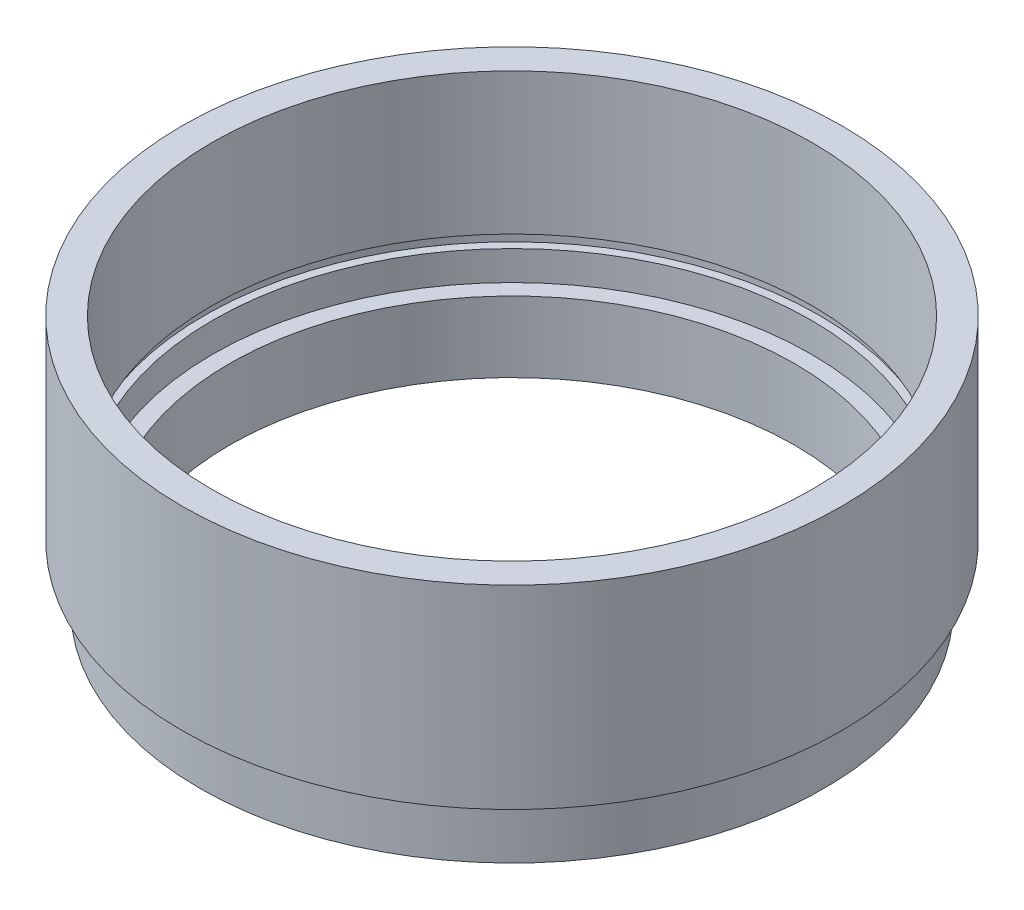
ISO-10303-21;
HEADER;
FILE_DESCRIPTION(('STEP AP214'),'2;1');
FILE_NAME('part.step','',(''),(''),'','','');
FILE_SCHEMA(('AUTOMOTIVE_DESIGN { 1 0 10303 214 1 1 1 1 }'));
ENDSEC;
DATA;
#1=APPLICATION_CONTEXT('core data for automotive mechanical design processes');
#2=APPLICATION_PROTOCOL_DEFINITION('international standard','automotive_design',2000,#1);
#3=PRODUCT_CONTEXT('',#1,'mechanical');
#4=PRODUCT('Part','Part','',(#3));
#5=PRODUCT_RELATED_PRODUCT_CATEGORY('part','',(#4));
#6=PRODUCT_DEFINITION_FORMATION('','',#4);
#7=PRODUCT_DEFINITION_CONTEXT('part definition',#1,'design');
#8=PRODUCT_DEFINITION('design','',#6,#7);
#9=PRODUCT_DEFINITION_SHAPE('','',#8);
#10=(LENGTH_UNIT() NAMED_UNIT(*) SI_UNIT(.MILLI.,.METRE.));
#11=(NAMED_UNIT(*) PLANE_ANGLE_UNIT() SI_UNIT($,.RADIAN.));
#12=(NAMED_UNIT(*) SI_UNIT($,.STERADIAN.) SOLID_ANGLE_UNIT());
#13=UNCERTAINTY_MEASURE_WITH_UNIT(LENGTH_MEASURE(1.E-05),#10,'distance_accuracy_value','');
#14=(GEOMETRIC_REPRESENTATION_CONTEXT(3) GLOBAL_UNCERTAINTY_ASSIGNED_CONTEXT((#13)) GLOBAL_UNIT_ASSIGNED_CONTEXT((#10,
#11,#12)) REPRESENTATION_CONTEXT('',''));
#15=CARTESIAN_POINT('',(0.,0.,0.));
#16=DIRECTION('',(0.,0.,1.));
#17=DIRECTION('',(1.,0.,0.));
#18=AXIS2_PLACEMENT_3D('',#15,#16,#17);
#19=CARTESIAN_POINT('',(0.,0.,0.));
#20=DIRECTION('',(0.,-1.,0.));
#21=DIRECTION('',(0.,0.,-1.));
#22=AXIS2_PLACEMENT_3D('',#19,#20,#21);
#23=CYLINDRICAL_SURFACE('',#22,24.);
#24=CARTESIAN_POINT('',(0.,0.,0.));
#25=DIRECTION('',(0.,-1.,0.));
#26=DIRECTION('',(0.,0.,-1.));
#27=AXIS2_PLACEMENT_3D('',#24,#25,#26);
#28=CIRCLE('',#27,24.);
#29=CARTESIAN_POINT('',(0.,0.,-24.));
#30=VERTEX_POINT('',#29);
#31=EDGE_CURVE('E10',#30,#30,#28,.T.);
#32=ORIENTED_EDGE('',*,*,#31,.T.);
#33=EDGE_LOOP('',(#32));
#34=FACE_BOUND('',#33,.T.);
#35=CARTESIAN_POINT('',(0.,6.,0.));
#36=DIRECTION('',(0.,-1.,0.));
#37=DIRECTION('',(0.,0.,-1.));
#38=AXIS2_PLACEMENT_3D('',#35,#36,#37);
#39=CIRCLE('',#38,24.);
#40=CARTESIAN_POINT('',(0.,6.,-24.));
#41=VERTEX_POINT('',#40);
#42=EDGE_CURVE('E102',#41,#41,#39,.T.);
#43=ORIENTED_EDGE('',*,*,#42,.F.);
#44=EDGE_LOOP('',(#43));
#45=FACE_BOUND('',#44,.T.);
#46=ADVANCED_FACE('F43',(#34,#45),#23,.F.);
#47=CARTESIAN_POINT('',(24.,0.,0.));
#48=DIRECTION('',(0.,-1.,0.));
#49=DIRECTION('',(0.,0.,-1.));
#50=AXIS2_PLACEMENT_3D('',#47,#48,#49);
#51=PLANE('',#50);
#52=CARTESIAN_POINT('',(0.,0.,0.));
#53=DIRECTION('',(0.,-1.,0.));
#54=DIRECTION('',(0.,0.,-1.));
#55=AXIS2_PLACEMENT_3D('',#52,#53,#54);
#56=CIRCLE('',#55,26.5);
#57=CARTESIAN_POINT('',(0.,0.,-26.5));
#58=VERTEX_POINT('',#57);
#59=EDGE_CURVE('E50',#58,#58,#56,.T.);
#60=ORIENTED_EDGE('',*,*,#59,.T.);
#61=EDGE_LOOP('',(#60));
#62=FACE_BOUND('',#61,.T.);
#63=ORIENTED_EDGE('',*,*,#31,.F.);
#64=EDGE_LOOP('',(#63));
#65=FACE_BOUND('',#64,.T.);
#66=ADVANCED_FACE('F111',(#62,#65),#51,.T.);
#67=CARTESIAN_POINT('',(0.,0.,0.));
#68=DIRECTION('',(0.,-1.,0.));
#69=DIRECTION('',(0.,0.,-1.));
#70=AXIS2_PLACEMENT_3D('',#67,#68,#69);
#71=CYLINDRICAL_SURFACE('',#70,26.5);
#72=CARTESIAN_POINT('',(0.,4.,0.));
#73=DIRECTION('',(0.,-1.,0.));
#74=DIRECTION('',(0.,0.,-1.));
#75=AXIS2_PLACEMENT_3D('',#72,#73,#74);
#76=CIRCLE('',#75,26.5);
#77=CARTESIAN_POINT('',(0.,4.,-26.5));
#78=VERTEX_POINT('',#77);
#79=EDGE_CURVE('E57',#78,#78,#76,.T.);
#80=ORIENTED_EDGE('',*,*,#79,.T.);
#81=EDGE_LOOP('',(#80));
#82=FACE_BOUND('',#81,.T.);
#83=ORIENTED_EDGE('',*,*,#59,.F.);
#84=EDGE_LOOP('',(#83));
#85=FACE_BOUND('',#84,.T.);
#86=ADVANCED_FACE('F115',(#82,#85),#71,.T.);
#87=CARTESIAN_POINT('',(26.5,4.,0.));
#88=DIRECTION('',(0.,1.,0.));
#89=DIRECTION('',(0.,0.,1.));
#90=AXIS2_PLACEMENT_3D('',#87,#88,#89);
#91=PLANE('',#90);
#92=CARTESIAN_POINT('',(0.,4.,0.));
#93=DIRECTION('',(0.,-1.,0.));
#94=DIRECTION('',(0.,0.,-1.));
#95=AXIS2_PLACEMENT_3D('',#92,#93,#94);
#96=CIRCLE('',#95,25.5);
#97=CARTESIAN_POINT('',(0.,4.,-25.5));
#98=VERTEX_POINT('',#97);
#99=EDGE_CURVE('E64',#98,#98,#96,.T.);
#100=ORIENTED_EDGE('',*,*,#99,.T.);
#101=EDGE_LOOP('',(#100));
#102=FACE_BOUND('',#101,.T.);
#103=ORIENTED_EDGE('',*,*,#79,.F.);
#104=EDGE_LOOP('',(#103));
#105=FACE_BOUND('',#104,.T.);
#106=ADVANCED_FACE('F119',(#102,#105),#91,.T.);
#107=CARTESIAN_POINT('',(0.,0.,0.));
#108=DIRECTION('',(0.,-1.,0.));
#109=DIRECTION('',(0.,0.,-1.));
#110=AXIS2_PLACEMENT_3D('',#107,#108,#109);
#111=CYLINDRICAL_SURFACE('',#110,25.5);
#112=CARTESIAN_POINT('',(0.,5.,0.));
#113=DIRECTION('',(0.,-1.,0.));
#114=DIRECTION('',(0.,0.,-1.));
#115=AXIS2_PLACEMENT_3D('',#112,#113,#114);
#116=CIRCLE('',#115,25.5);
#117=CARTESIAN_POINT('',(0.,5.,-25.5));
#118=VERTEX_POINT('',#117);
#119=EDGE_CURVE('E69',#118,#118,#116,.T.);
#120=ORIENTED_EDGE('',*,*,#119,.T.);
#121=EDGE_LOOP('',(#120));
#122=FACE_BOUND('',#121,.T.);
#123=ORIENTED_EDGE('',*,*,#99,.F.);
#124=EDGE_LOOP('',(#123));
#125=FACE_BOUND('',#124,.T.);
#126=ADVANCED_FACE('F126',(#122,#125),#111,.T.);
#127=CARTESIAN_POINT('',(25.5,5.,0.));
#128=DIRECTION('',(0.,-1.,0.));
#129=DIRECTION('',(0.,0.,-1.));
#130=AXIS2_PLACEMENT_3D('',#127,#128,#129);
#131=PLANE('',#130);
#132=CARTESIAN_POINT('',(0.,5.,0.));
#133=DIRECTION('',(0.,-1.,0.));
#134=DIRECTION('',(0.,0.,-1.));
#135=AXIS2_PLACEMENT_3D('',#132,#133,#134);
#136=CIRCLE('',#135,28.);
#137=CARTESIAN_POINT('',(0.,5.,-28.));
#138=VERTEX_POINT('',#137);
#139=EDGE_CURVE('E73',#138,#138,#136,.T.);
#140=ORIENTED_EDGE('',*,*,#139,.T.);
#141=EDGE_LOOP('',(#140));
#142=FACE_BOUND('',#141,.T.);
#143=ORIENTED_EDGE('',*,*,#119,.F.);
#144=EDGE_LOOP('',(#143));
#145=FACE_BOUND('',#144,.T.);
#146=ADVANCED_FACE('F130',(#142,#145),#131,.T.);
#147=CARTESIAN_POINT('',(0.,0.,0.));
#148=DIRECTION('',(0.,-1.,0.));
#149=DIRECTION('',(0.,0.,-1.));
#150=AXIS2_PLACEMENT_3D('',#147,#148,#149);
#151=CYLINDRICAL_SURFACE('',#150,28.);
#152=CARTESIAN_POINT('',(0.,21.5,0.));
#153=DIRECTION('',(0.,-1.,0.));
#154=DIRECTION('',(0.,0.,-1.));
#155=AXIS2_PLACEMENT_3D('',#152,#153,#154);
#156=CIRCLE('',#155,28.);
#157=CARTESIAN_POINT('',(0.,21.5,-28.));
#158=VERTEX_POINT('',#157);
#159=EDGE_CURVE('E77',#158,#158,#156,.T.);
#160=ORIENTED_EDGE('',*,*,#159,.T.);
#161=EDGE_LOOP('',(#160));
#162=FACE_BOUND('',#161,.T.);
#163=ORIENTED_EDGE('',*,*,#139,.F.);
#164=EDGE_LOOP('',(#163));
#165=FACE_BOUND('',#164,.T.);
#166=ADVANCED_FACE('F134',(#162,#165),#151,.T.);
#167=CARTESIAN_POINT('',(28.,21.5,0.));
#168=DIRECTION('',(0.,1.,0.));
#169=DIRECTION('',(0.,0.,1.));
#170=AXIS2_PLACEMENT_3D('',#167,#168,#169);
#171=PLANE('',#170);
#172=CARTESIAN_POINT('',(0.,21.5,0.));
#173=DIRECTION('',(0.,-1.,0.));
#174=DIRECTION('',(0.,0.,-1.));
#175=AXIS2_PLACEMENT_3D('',#172,#173,#174);
#176=CIRCLE('',#175,25.5);
#177=CARTESIAN_POINT('',(0.,21.5,-25.5));
#178=VERTEX_POINT('',#177);
#179=EDGE_CURVE('E81',#178,#178,#176,.T.);
#180=ORIENTED_EDGE('',*,*,#179,.T.);
#181=EDGE_LOOP('',(#180));
#182=FACE_BOUND('',#181,.T.);
#183=ORIENTED_EDGE('',*,*,#159,.F.);
#184=EDGE_LOOP('',(#183));
#185=FACE_BOUND('',#184,.T.);
#186=ADVANCED_FACE('F138',(#182,#185),#171,.T.);
#187=CARTESIAN_POINT('',(0.,0.,0.));
#188=DIRECTION('',(0.,-1.,0.));
#189=DIRECTION('',(0.,0.,-1.));
#190=AXIS2_PLACEMENT_3D('',#187,#188,#189);
#191=CYLINDRICAL_SURFACE('',#190,25.5);
#192=CARTESIAN_POINT('',(0.,9.5,0.));
#193=DIRECTION('',(0.,-1.,0.));
#194=DIRECTION('',(0.,0.,-1.));
#195=AXIS2_PLACEMENT_3D('',#192,#193,#194);
#196=CIRCLE('',#195,25.5);
#197=CARTESIAN_POINT('',(0.,9.5,-25.5));
#198=VERTEX_POINT('',#197);
#199=EDGE_CURVE('E84',#198,#198,#196,.T.);
#200=ORIENTED_EDGE('',*,*,#199,.T.);
#201=EDGE_LOOP('',(#200));
#202=FACE_BOUND('',#201,.T.);
#203=ORIENTED_EDGE('',*,*,#179,.F.);
#204=EDGE_LOOP('',(#203));
#205=FACE_BOUND('',#204,.T.);
#206=ADVANCED_FACE('F142',(#202,#205),#191,.F.);
#207=CARTESIAN_POINT('',(25.5,9.5,0.));
#208=DIRECTION('',(0.,-1.,0.));
#209=DIRECTION('',(0.,0.,-1.));
#210=AXIS2_PLACEMENT_3D('',#207,#208,#209);
#211=PLANE('',#210);
#212=CARTESIAN_POINT('',(0.,9.5,0.));
#213=DIRECTION('',(0.,-1.,0.));
#214=DIRECTION('',(0.,0.,-1.));
#215=AXIS2_PLACEMENT_3D('',#212,#213,#214);
#216=CIRCLE('',#215,26.1);
#217=CARTESIAN_POINT('',(0.,9.5,-26.1));
#218=VERTEX_POINT('',#217);
#219=EDGE_CURVE('E88',#218,#218,#216,.T.);
#220=ORIENTED_EDGE('',*,*,#219,.T.);
#221=EDGE_LOOP('',(#220));
#222=FACE_BOUND('',#221,.T.);
#223=ORIENTED_EDGE('',*,*,#199,.F.);
#224=EDGE_LOOP('',(#223));
#225=FACE_BOUND('',#224,.T.);
#226=ADVANCED_FACE('F146',(#222,#225),#211,.T.);
#227=CARTESIAN_POINT('',(0.,0.,0.));
#228=DIRECTION('',(0.,-1.,0.));
#229=DIRECTION('',(0.,0.,-1.));
#230=AXIS2_PLACEMENT_3D('',#227,#228,#229);
#231=CYLINDRICAL_SURFACE('',#230,26.1);
#232=CARTESIAN_POINT('',(0.,8.5,0.));
#233=DIRECTION('',(0.,-1.,0.));
#234=DIRECTION('',(0.,0.,-1.));
#235=AXIS2_PLACEMENT_3D('',#232,#233,#234);
#236=CIRCLE('',#235,26.1);
#237=CARTESIAN_POINT('',(0.,8.5,-26.1));
#238=VERTEX_POINT('',#237);
#239=EDGE_CURVE('E92',#238,#238,#236,.T.);
#240=ORIENTED_EDGE('',*,*,#239,.T.);
#241=EDGE_LOOP('',(#240));
#242=FACE_BOUND('',#241,.T.);
#243=ORIENTED_EDGE('',*,*,#219,.F.);
#244=EDGE_LOOP('',(#243));
#245=FACE_BOUND('',#244,.T.);
#246=ADVANCED_FACE('F150',(#242,#245),#231,.F.);
#247=CARTESIAN_POINT('',(26.1,8.5,0.));
#248=DIRECTION('',(0.,1.,0.));
#249=DIRECTION('',(0.,0.,1.));
#250=AXIS2_PLACEMENT_3D('',#247,#248,#249);
#251=PLANE('',#250);
#252=CARTESIAN_POINT('',(0.,8.5,0.));
#253=DIRECTION('',(0.,-1.,0.));
#254=DIRECTION('',(0.,0.,-1.));
#255=AXIS2_PLACEMENT_3D('',#252,#253,#254);
#256=CIRCLE('',#255,25.4);
#257=CARTESIAN_POINT('',(0.,8.5,-25.4));
#258=VERTEX_POINT('',#257);
#259=EDGE_CURVE('E95',#258,#258,#256,.T.);
#260=ORIENTED_EDGE('',*,*,#259,.T.);
#261=EDGE_LOOP('',(#260));
#262=FACE_BOUND('',#261,.T.);
#263=ORIENTED_EDGE('',*,*,#239,.F.);
#264=EDGE_LOOP('',(#263));
#265=FACE_BOUND('',#264,.T.);
#266=ADVANCED_FACE('F154',(#262,#265),#251,.T.);
#267=CARTESIAN_POINT('',(0.,0.,0.));
#268=DIRECTION('',(0.,-1.,0.));
#269=DIRECTION('',(0.,0.,-1.));
#270=AXIS2_PLACEMENT_3D('',#267,#268,#269);
#271=CYLINDRICAL_SURFACE('',#270,25.4);
#272=CARTESIAN_POINT('',(0.,6.,0.));
#273=DIRECTION('',(0.,-1.,0.));
#274=DIRECTION('',(0.,0.,-1.));
#275=AXIS2_PLACEMENT_3D('',#272,#273,#274);
#276=CIRCLE('',#275,25.4);
#277=CARTESIAN_POINT('',(0.,6.,-25.4));
#278=VERTEX_POINT('',#277);
#279=EDGE_CURVE('E98',#278,#278,#276,.T.);
#280=ORIENTED_EDGE('',*,*,#279,.T.);
#281=EDGE_LOOP('',(#280));
#282=FACE_BOUND('',#281,.T.);
#283=ORIENTED_EDGE('',*,*,#259,.F.);
#284=EDGE_LOOP('',(#283));
#285=FACE_BOUND('',#284,.T.);
#286=ADVANCED_FACE('F158',(#282,#285),#271,.F.);
#287=CARTESIAN_POINT('',(25.4,6.,0.));
#288=DIRECTION('',(0.,1.,0.));
#289=DIRECTION('',(0.,0.,1.));
#290=AXIS2_PLACEMENT_3D('',#287,#288,#289);
#291=PLANE('',#290);
#292=ORIENTED_EDGE('',*,*,#42,.T.);
#293=EDGE_LOOP('',(#292));
#294=FACE_BOUND('',#293,.T.);
#295=ORIENTED_EDGE('',*,*,#279,.F.);
#296=EDGE_LOOP('',(#295));
#297=FACE_BOUND('',#296,.T.);
#298=ADVANCED_FACE('F107',(#294,#297),#291,.T.);
#299=CLOSED_SHELL('',(#46,#66,#86,#106,#126,#146,#166,#186,#206,#226,#246,#266,#286,#298));
#300=MANIFOLD_SOLID_BREP('B2',#299);
#301=ADVANCED_BREP_SHAPE_REPRESENTATION('',(#18,#300),#14);
#302=SHAPE_DEFINITION_REPRESENTATION(#9,#301);
ENDSEC;
END-ISO-10303-21;
